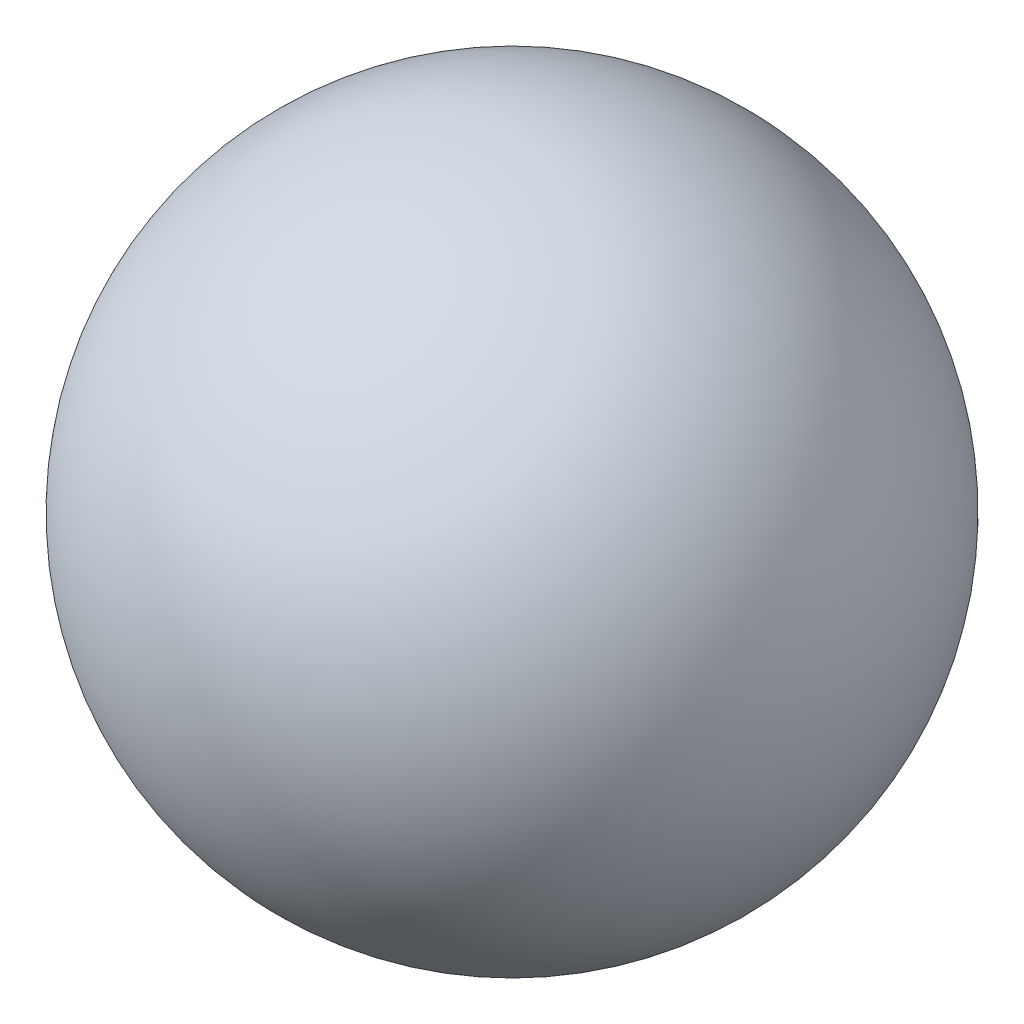
ISO-10303-21;
HEADER;
FILE_DESCRIPTION(('STEP AP214'),'2;1');
FILE_NAME('part.step','',(''),(''),'','','');
FILE_SCHEMA(('AUTOMOTIVE_DESIGN { 1 0 10303 214 1 1 1 1 }'));
ENDSEC;
DATA;
#1=APPLICATION_CONTEXT('core data for automotive mechanical design processes');
#2=APPLICATION_PROTOCOL_DEFINITION('international standard','automotive_design',2000,#1);
#3=PRODUCT_CONTEXT('',#1,'mechanical');
#4=PRODUCT('Part','Part','',(#3));
#5=PRODUCT_RELATED_PRODUCT_CATEGORY('part','',(#4));
#6=PRODUCT_DEFINITION_FORMATION('','',#4);
#7=PRODUCT_DEFINITION_CONTEXT('part definition',#1,'design');
#8=PRODUCT_DEFINITION('design','',#6,#7);
#9=PRODUCT_DEFINITION_SHAPE('','',#8);
#10=(LENGTH_UNIT() NAMED_UNIT(*) SI_UNIT(.MILLI.,.METRE.));
#11=(NAMED_UNIT(*) PLANE_ANGLE_UNIT() SI_UNIT($,.RADIAN.));
#12=(NAMED_UNIT(*) SI_UNIT($,.STERADIAN.) SOLID_ANGLE_UNIT());
#13=UNCERTAINTY_MEASURE_WITH_UNIT(LENGTH_MEASURE(1.E-05),#10,'distance_accuracy_value','');
#14=(GEOMETRIC_REPRESENTATION_CONTEXT(3) GLOBAL_UNCERTAINTY_ASSIGNED_CONTEXT((#13)) GLOBAL_UNIT_ASSIGNED_CONTEXT((#10,
#11,#12)) REPRESENTATION_CONTEXT('',''));
#15=CARTESIAN_POINT('',(0.,0.,0.));
#16=DIRECTION('',(0.,0.,1.));
#17=DIRECTION('',(1.,0.,0.));
#18=AXIS2_PLACEMENT_3D('',#15,#16,#17);
#19=CARTESIAN_POINT('',(67.76,-44.232136903979,53.4096790961869));
#20=DIRECTION('',(0.,-0.637833186545712,0.770174542646628));
#21=DIRECTION('',(0.173648177666934,-0.758473860771031,-0.628143067238699));
#22=AXIS2_PLACEMENT_3D('',#19,#20,#21);
#23=SPHERICAL_SURFACE('',#22,7.15);
#24=CARTESIAN_POINT('',(67.76,-48.7926441877808,58.9164270761103));
#25=VERTEX_POINT('',#24);
#26=VERTEX_LOOP('',#25);
#27=FACE_BOUND('',#26,.T.);
#28=CARTESIAN_POINT('',(67.76,-39.6716296201772,47.9029311162635));
#29=VERTEX_POINT('',#28);
#30=VERTEX_LOOP('',#29);
#31=FACE_BOUND('',#30,.T.);
#32=ADVANCED_FACE('F16',(#27,#31),#23,.T.);
#33=CLOSED_SHELL('',(#32));
#34=MANIFOLD_SOLID_BREP('B1',#33);
#35=ADVANCED_BREP_SHAPE_REPRESENTATION('',(#18,#34),#14);
#36=SHAPE_DEFINITION_REPRESENTATION(#9,#35);
ENDSEC;
END-ISO-10303-21;
